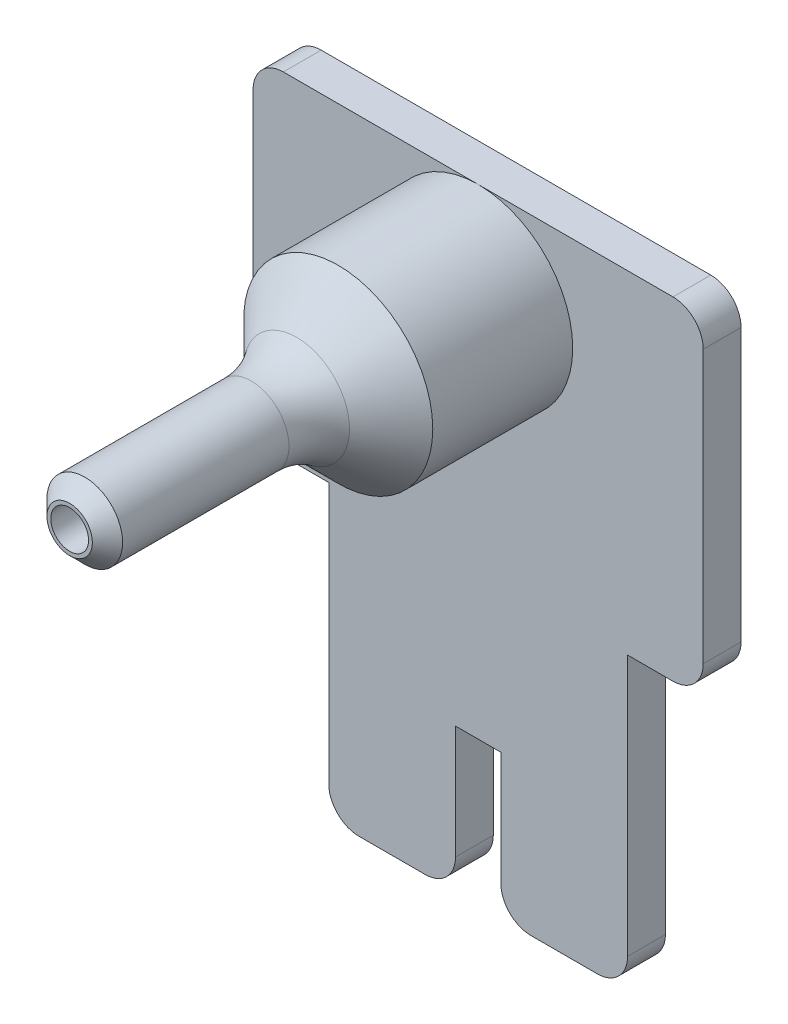
ISO-10303-21;
HEADER;
FILE_DESCRIPTION(('STEP AP214'),'2;1');
FILE_NAME('part.step','',(''),(''),'','','');
FILE_SCHEMA(('AUTOMOTIVE_DESIGN { 1 0 10303 214 1 1 1 1 }'));
ENDSEC;
DATA;
#1=APPLICATION_CONTEXT('core data for automotive mechanical design processes');
#2=APPLICATION_PROTOCOL_DEFINITION('international standard','automotive_design',2000,#1);
#3=PRODUCT_CONTEXT('',#1,'mechanical');
#4=PRODUCT('Part','Part','',(#3));
#5=PRODUCT_RELATED_PRODUCT_CATEGORY('part','',(#4));
#6=PRODUCT_DEFINITION_FORMATION('','',#4);
#7=PRODUCT_DEFINITION_CONTEXT('part definition',#1,'design');
#8=PRODUCT_DEFINITION('design','',#6,#7);
#9=PRODUCT_DEFINITION_SHAPE('','',#8);
#10=(LENGTH_UNIT() NAMED_UNIT(*) SI_UNIT(.MILLI.,.METRE.));
#11=(NAMED_UNIT(*) PLANE_ANGLE_UNIT() SI_UNIT($,.RADIAN.));
#12=(NAMED_UNIT(*) SI_UNIT($,.STERADIAN.) SOLID_ANGLE_UNIT());
#13=UNCERTAINTY_MEASURE_WITH_UNIT(LENGTH_MEASURE(1.E-05),#10,'distance_accuracy_value','');
#14=(GEOMETRIC_REPRESENTATION_CONTEXT(3) GLOBAL_UNCERTAINTY_ASSIGNED_CONTEXT((#13)) GLOBAL_UNIT_ASSIGNED_CONTEXT((#10,
#11,#12)) REPRESENTATION_CONTEXT('',''));
#15=CARTESIAN_POINT('',(0.,0.,0.));
#16=DIRECTION('',(0.,0.,1.));
#17=DIRECTION('',(1.,0.,0.));
#18=AXIS2_PLACEMENT_3D('',#15,#16,#17);
#19=CARTESIAN_POINT('',(0.,17.5,-17.6776695296637));
#20=DIRECTION('',(0.,0.,1.));
#21=DIRECTION('',(1.,0.,0.));
#22=AXIS2_PLACEMENT_3D('',#19,#20,#21);
#23=CYLINDRICAL_SURFACE('',#22,6.25);
#24=CARTESIAN_POINT('',(0.,17.5,11.75));
#25=DIRECTION('',(0.,0.,1.));
#26=DIRECTION('',(1.,0.,0.));
#27=AXIS2_PLACEMENT_3D('',#24,#25,#26);
#28=CIRCLE('',#27,6.25);
#29=CARTESIAN_POINT('',(6.25,17.5,11.75));
#30=VERTEX_POINT('',#29);
#31=EDGE_CURVE('E394',#30,#30,#28,.F.);
#32=ORIENTED_EDGE('',*,*,#31,.T.);
#33=EDGE_LOOP('',(#32));
#34=FACE_BOUND('',#33,.T.);
#35=CARTESIAN_POINT('',(0.,17.5,2.5));
#36=DIRECTION('',(0.,0.,-1.));
#37=DIRECTION('',(-1.,0.,0.));
#38=AXIS2_PLACEMENT_3D('',#35,#36,#37);
#39=CIRCLE('',#38,6.25);
#40=CARTESIAN_POINT('',(0.,23.75,2.5));
#41=VERTEX_POINT('',#40);
#42=EDGE_CURVE('E225',#41,#41,#39,.T.);
#43=ORIENTED_EDGE('',*,*,#42,.F.);
#44=EDGE_LOOP('',(#43));
#45=FACE_BOUND('',#44,.T.);
#46=ADVANCED_FACE('F76',(#34,#45),#23,.T.);
#47=CARTESIAN_POINT('',(0.,17.5,0.));
#48=DIRECTION('',(0.,0.,1.));
#49=DIRECTION('',(1.,0.,0.));
#50=AXIS2_PLACEMENT_3D('',#47,#48,#49);
#51=CYLINDRICAL_SURFACE('',#50,1.25);
#52=CARTESIAN_POINT('',(0.,17.5,29.5));
#53=DIRECTION('',(0.,0.,1.));
#54=DIRECTION('',(1.,0.,0.));
#55=AXIS2_PLACEMENT_3D('',#52,#53,#54);
#56=CIRCLE('',#55,1.25);
#57=CARTESIAN_POINT('',(1.25,17.5,29.5));
#58=VERTEX_POINT('',#57);
#59=EDGE_CURVE('E262',#58,#58,#56,.T.);
#60=ORIENTED_EDGE('',*,*,#59,.T.);
#61=EDGE_LOOP('',(#60));
#62=FACE_BOUND('',#61,.T.);
#63=CARTESIAN_POINT('',(0.,17.5,12.));
#64=DIRECTION('',(0.,0.,-1.));
#65=DIRECTION('',(-1.,0.,0.));
#66=AXIS2_PLACEMENT_3D('',#63,#64,#65);
#67=CIRCLE('',#66,1.25);
#68=CARTESIAN_POINT('',(-1.25,17.5,12.));
#69=VERTEX_POINT('',#68);
#70=EDGE_CURVE('E254',#69,#69,#67,.F.);
#71=ORIENTED_EDGE('',*,*,#70,.F.);
#72=EDGE_LOOP('',(#71));
#73=FACE_BOUND('',#72,.T.);
#74=ADVANCED_FACE('F418',(#62,#73),#51,.F.);
#75=CARTESIAN_POINT('',(-9.875,-17.5,2.5));
#76=DIRECTION('',(0.,1.,0.));
#77=DIRECTION('',(0.,0.,1.));
#78=AXIS2_PLACEMENT_3D('',#75,#76,#77);
#79=PLANE('',#78);
#80=DIRECTION('',(1.,0.,0.));
#81=VECTOR('',#80,1.);
#82=CARTESIAN_POINT('',(-9.875,-17.5,2.5));
#83=LINE('',#82,#81);
#84=CARTESIAN_POINT('',(3.49999999999999,-17.5,2.5));
#85=VERTEX_POINT('',#84);
#86=CARTESIAN_POINT('',(7.875,-17.5,2.5));
#87=VERTEX_POINT('',#86);
#88=EDGE_CURVE('E314',#85,#87,#83,.T.);
#89=ORIENTED_EDGE('',*,*,#88,.F.);
#90=DIRECTION('',(0.,0.,1.));
#91=VECTOR('',#90,1.);
#92=CARTESIAN_POINT('',(3.49999999999999,-17.5,2.5));
#93=LINE('',#92,#91);
#94=CARTESIAN_POINT('',(3.49999999999999,-17.5,0.));
#95=VERTEX_POINT('',#94);
#96=EDGE_CURVE('E375',#85,#95,#93,.F.);
#97=ORIENTED_EDGE('',*,*,#96,.T.);
#98=DIRECTION('',(1.,0.,0.));
#99=VECTOR('',#98,1.);
#100=CARTESIAN_POINT('',(-9.875,-17.5,0.));
#101=LINE('',#100,#99);
#102=CARTESIAN_POINT('',(7.875,-17.5,0.));
#103=VERTEX_POINT('',#102);
#104=EDGE_CURVE('E322',#95,#103,#101,.T.);
#105=ORIENTED_EDGE('',*,*,#104,.T.);
#106=DIRECTION('',(0.,0.,-1.));
#107=VECTOR('',#106,1.);
#108=CARTESIAN_POINT('',(7.875,-17.5,2.5));
#109=LINE('',#108,#107);
#110=EDGE_CURVE('E373',#103,#87,#109,.F.);
#111=ORIENTED_EDGE('',*,*,#110,.T.);
#112=EDGE_LOOP('',(#89,#97,#105,#111));
#113=FACE_BOUND('',#112,.T.);
#114=ADVANCED_FACE('F420',(#113),#79,.F.);
#115=CARTESIAN_POINT('',(9.875,-17.5,2.5));
#116=DIRECTION('',(-1.,0.,0.));
#117=DIRECTION('',(0.,0.,1.));
#118=AXIS2_PLACEMENT_3D('',#115,#116,#117);
#119=PLANE('',#118);
#120=DIRECTION('',(0.,1.,0.));
#121=VECTOR('',#120,1.);
#122=CARTESIAN_POINT('',(9.875,-17.5,2.5));
#123=LINE('',#122,#121);
#124=CARTESIAN_POINT('',(9.875,-15.5,2.5));
#125=VERTEX_POINT('',#124);
#126=CARTESIAN_POINT('',(9.875,1.74999999999999,2.5));
#127=VERTEX_POINT('',#126);
#128=EDGE_CURVE('E308',#125,#127,#123,.T.);
#129=ORIENTED_EDGE('',*,*,#128,.F.);
#130=DIRECTION('',(0.,0.,-1.));
#131=VECTOR('',#130,1.);
#132=CARTESIAN_POINT('',(9.875,-15.5,2.5));
#133=LINE('',#132,#131);
#134=CARTESIAN_POINT('',(9.875,-15.5,0.));
#135=VERTEX_POINT('',#134);
#136=EDGE_CURVE('E377',#125,#135,#133,.T.);
#137=ORIENTED_EDGE('',*,*,#136,.T.);
#138=DIRECTION('',(0.,1.,0.));
#139=VECTOR('',#138,1.);
#140=CARTESIAN_POINT('',(9.875,-17.5,0.));
#141=LINE('',#140,#139);
#142=CARTESIAN_POINT('',(9.875,1.74999999999999,0.));
#143=VERTEX_POINT('',#142);
#144=EDGE_CURVE('E305',#135,#143,#141,.T.);
#145=ORIENTED_EDGE('',*,*,#144,.T.);
#146=DIRECTION('',(0.,0.,1.));
#147=VECTOR('',#146,1.);
#148=CARTESIAN_POINT('',(9.875,1.74999999999999,2.5));
#149=LINE('',#148,#147);
#150=EDGE_CURVE('E283',#143,#127,#149,.T.);
#151=ORIENTED_EDGE('',*,*,#150,.T.);
#152=EDGE_LOOP('',(#129,#137,#145,#151));
#153=FACE_BOUND('',#152,.T.);
#154=ADVANCED_FACE('F427',(#153),#119,.F.);
#155=CARTESIAN_POINT('',(-9.875,-17.5,2.5));
#156=DIRECTION('',(1.,0.,0.));
#157=DIRECTION('',(0.,0.,-1.));
#158=AXIS2_PLACEMENT_3D('',#155,#156,#157);
#159=PLANE('',#158);
#160=DIRECTION('',(0.,-1.,0.));
#161=VECTOR('',#160,1.);
#162=CARTESIAN_POINT('',(-9.875,-17.5,0.));
#163=LINE('',#162,#161);
#164=CARTESIAN_POINT('',(-9.875,1.74999999999999,0.));
#165=VERTEX_POINT('',#164);
#166=CARTESIAN_POINT('',(-9.875,-15.5,0.));
#167=VERTEX_POINT('',#166);
#168=EDGE_CURVE('E319',#165,#167,#163,.T.);
#169=ORIENTED_EDGE('',*,*,#168,.T.);
#170=DIRECTION('',(0.,0.,-1.));
#171=VECTOR('',#170,1.);
#172=CARTESIAN_POINT('',(-9.875,-15.5,2.5));
#173=LINE('',#172,#171);
#174=CARTESIAN_POINT('',(-9.875,-15.5,2.5));
#175=VERTEX_POINT('',#174);
#176=EDGE_CURVE('E380',#167,#175,#173,.F.);
#177=ORIENTED_EDGE('',*,*,#176,.T.);
#178=DIRECTION('',(0.,-1.,0.));
#179=VECTOR('',#178,1.);
#180=CARTESIAN_POINT('',(-9.875,-17.5,2.5));
#181=LINE('',#180,#179);
#182=CARTESIAN_POINT('',(-9.875,1.74999999999999,2.5));
#183=VERTEX_POINT('',#182);
#184=EDGE_CURVE('E310',#183,#175,#181,.T.);
#185=ORIENTED_EDGE('',*,*,#184,.F.);
#186=DIRECTION('',(0.,0.,-1.));
#187=VECTOR('',#186,1.);
#188=CARTESIAN_POINT('',(-9.875,1.74999999999999,2.5));
#189=LINE('',#188,#187);
#190=EDGE_CURVE('E275',#183,#165,#189,.T.);
#191=ORIENTED_EDGE('',*,*,#190,.T.);
#192=EDGE_LOOP('',(#169,#177,#185,#191));
#193=FACE_BOUND('',#192,.T.);
#194=ADVANCED_FACE('F473',(#193),#159,.F.);
#195=CARTESIAN_POINT('',(-7.875,-17.5,0.));
#196=VERTEX_POINT('',#195);
#197=CARTESIAN_POINT('',(-3.5,-17.5,0.));
#198=VERTEX_POINT('',#197);
#199=EDGE_CURVE('E311',#196,#198,#101,.T.);
#200=ORIENTED_EDGE('',*,*,#199,.T.);
#201=DIRECTION('',(0.,0.,1.));
#202=VECTOR('',#201,1.);
#203=CARTESIAN_POINT('',(-3.5,-17.5,2.5));
#204=LINE('',#203,#202);
#205=CARTESIAN_POINT('',(-3.5,-17.5,2.5));
#206=VERTEX_POINT('',#205);
#207=EDGE_CURVE('E342',#198,#206,#204,.T.);
#208=ORIENTED_EDGE('',*,*,#207,.T.);
#209=CARTESIAN_POINT('',(-7.875,-17.5,2.5));
#210=VERTEX_POINT('',#209);
#211=EDGE_CURVE('E317',#210,#206,#83,.T.);
#212=ORIENTED_EDGE('',*,*,#211,.F.);
#213=DIRECTION('',(0.,0.,-1.));
#214=VECTOR('',#213,1.);
#215=CARTESIAN_POINT('',(-7.875,-17.5,2.5));
#216=LINE('',#215,#214);
#217=EDGE_CURVE('E339',#210,#196,#216,.T.);
#218=ORIENTED_EDGE('',*,*,#217,.T.);
#219=EDGE_LOOP('',(#200,#208,#212,#218));
#220=FACE_BOUND('',#219,.T.);
#221=ADVANCED_FACE('F430',(#220),#79,.F.);
#222=CARTESIAN_POINT('',(0.,0.,2.5));
#223=DIRECTION('',(0.,0.,-1.));
#224=DIRECTION('',(-1.,0.,0.));
#225=AXIS2_PLACEMENT_3D('',#222,#223,#224);
#226=PLANE('',#225);
#227=DIRECTION('',(1.,0.,0.));
#228=VECTOR('',#227,1.);
#229=CARTESIAN_POINT('',(0.,23.75,2.5));
#230=LINE('',#229,#228);
#231=CARTESIAN_POINT('',(12.875,23.75,2.5));
#232=VERTEX_POINT('',#231);
#233=EDGE_CURVE('E248',#41,#232,#230,.T.);
#234=ORIENTED_EDGE('',*,*,#233,.F.);
#235=ORIENTED_EDGE('',*,*,#42,.T.);
#236=DIRECTION('',(1.,0.,0.));
#237=VECTOR('',#236,1.);
#238=CARTESIAN_POINT('',(0.,23.75,2.5));
#239=LINE('',#238,#237);
#240=CARTESIAN_POINT('',(-12.875,23.75,2.5));
#241=VERTEX_POINT('',#240);
#242=EDGE_CURVE('E217',#241,#41,#239,.T.);
#243=ORIENTED_EDGE('',*,*,#242,.F.);
#244=CARTESIAN_POINT('',(-12.875,21.75,2.5));
#245=DIRECTION('',(0.,0.,-1.));
#246=DIRECTION('',(-1.,0.,0.));
#247=AXIS2_PLACEMENT_3D('',#244,#245,#246);
#248=CIRCLE('',#247,2.);
#249=CARTESIAN_POINT('',(-14.875,21.75,2.5));
#250=VERTEX_POINT('',#249);
#251=EDGE_CURVE('E222',#250,#241,#248,.T.);
#252=ORIENTED_EDGE('',*,*,#251,.F.);
#253=DIRECTION('',(0.,-1.,0.));
#254=VECTOR('',#253,1.);
#255=CARTESIAN_POINT('',(-14.875,17.5,2.5));
#256=LINE('',#255,#254);
#257=CARTESIAN_POINT('',(-14.875,3.74999999999999,2.5));
#258=VERTEX_POINT('',#257);
#259=EDGE_CURVE('E266',#250,#258,#256,.T.);
#260=ORIENTED_EDGE('',*,*,#259,.T.);
#261=CARTESIAN_POINT('',(-12.875,3.74999999999999,2.5));
#262=DIRECTION('',(0.,0.,-1.));
#263=DIRECTION('',(-1.,0.,0.));
#264=AXIS2_PLACEMENT_3D('',#261,#262,#263);
#265=CIRCLE('',#264,2.);
#266=CARTESIAN_POINT('',(-12.875,1.74999999999999,2.5));
#267=VERTEX_POINT('',#266);
#268=EDGE_CURVE('E347',#258,#267,#265,.F.);
#269=ORIENTED_EDGE('',*,*,#268,.T.);
#270=DIRECTION('',(1.,0.,0.));
#271=VECTOR('',#270,1.);
#272=CARTESIAN_POINT('',(-14.875,1.74999999999999,2.5));
#273=LINE('',#272,#271);
#274=EDGE_CURVE('E278',#267,#183,#273,.T.);
#275=ORIENTED_EDGE('',*,*,#274,.T.);
#276=ORIENTED_EDGE('',*,*,#184,.T.);
#277=CARTESIAN_POINT('',(-7.875,-15.5,2.5));
#278=DIRECTION('',(0.,0.,-1.));
#279=DIRECTION('',(-1.,0.,0.));
#280=AXIS2_PLACEMENT_3D('',#277,#278,#279);
#281=CIRCLE('',#280,2.);
#282=EDGE_CURVE('E349',#175,#210,#281,.F.);
#283=ORIENTED_EDGE('',*,*,#282,.T.);
#284=ORIENTED_EDGE('',*,*,#211,.T.);
#285=CARTESIAN_POINT('',(-3.5,-15.5,2.5));
#286=DIRECTION('',(0.,0.,-1.));
#287=DIRECTION('',(-1.,0.,0.));
#288=AXIS2_PLACEMENT_3D('',#285,#286,#287);
#289=CIRCLE('',#288,2.);
#290=CARTESIAN_POINT('',(-1.5,-15.5,2.5));
#291=VERTEX_POINT('',#290);
#292=EDGE_CURVE('E355',#206,#291,#289,.F.);
#293=ORIENTED_EDGE('',*,*,#292,.T.);
#294=DIRECTION('',(0.,-1.,0.));
#295=VECTOR('',#294,1.);
#296=CARTESIAN_POINT('',(-1.49999999999999,-17.5,2.5));
#297=LINE('',#296,#295);
#298=CARTESIAN_POINT('',(-1.50000000000001,-8.00000000000001,2.5));
#299=VERTEX_POINT('',#298);
#300=EDGE_CURVE('E290',#299,#291,#297,.T.);
#301=ORIENTED_EDGE('',*,*,#300,.F.);
#302=DIRECTION('',(-1.,0.,0.));
#303=VECTOR('',#302,1.);
#304=CARTESIAN_POINT('',(1.49999999999999,-8.00000000000001,2.5));
#305=LINE('',#304,#303);
#306=CARTESIAN_POINT('',(1.49999999999999,-8.00000000000001,2.5));
#307=VERTEX_POINT('',#306);
#308=EDGE_CURVE('E298',#307,#299,#305,.T.);
#309=ORIENTED_EDGE('',*,*,#308,.F.);
#310=DIRECTION('',(0.,1.,0.));
#311=VECTOR('',#310,1.);
#312=CARTESIAN_POINT('',(1.49999999999999,-17.5,2.5));
#313=LINE('',#312,#311);
#314=CARTESIAN_POINT('',(1.49999999999999,-15.5,2.5));
#315=VERTEX_POINT('',#314);
#316=EDGE_CURVE('E286',#315,#307,#313,.T.);
#317=ORIENTED_EDGE('',*,*,#316,.F.);
#318=CARTESIAN_POINT('',(3.49999999999999,-15.5,2.5));
#319=DIRECTION('',(0.,0.,-1.));
#320=DIRECTION('',(-1.,0.,0.));
#321=AXIS2_PLACEMENT_3D('',#318,#319,#320);
#322=CIRCLE('',#321,2.);
#323=EDGE_CURVE('E353',#315,#85,#322,.F.);
#324=ORIENTED_EDGE('',*,*,#323,.T.);
#325=ORIENTED_EDGE('',*,*,#88,.T.);
#326=CARTESIAN_POINT('',(7.875,-15.5,2.5));
#327=DIRECTION('',(0.,0.,-1.));
#328=DIRECTION('',(-1.,0.,0.));
#329=AXIS2_PLACEMENT_3D('',#326,#327,#328);
#330=CIRCLE('',#329,2.);
#331=EDGE_CURVE('E351',#87,#125,#330,.F.);
#332=ORIENTED_EDGE('',*,*,#331,.T.);
#333=ORIENTED_EDGE('',*,*,#128,.T.);
#334=CARTESIAN_POINT('',(12.875,1.74999999999999,2.5));
#335=VERTEX_POINT('',#334);
#336=EDGE_CURVE('E277',#127,#335,#273,.T.);
#337=ORIENTED_EDGE('',*,*,#336,.T.);
#338=CARTESIAN_POINT('',(12.875,3.74999999999999,2.5));
#339=DIRECTION('',(0.,0.,-1.));
#340=DIRECTION('',(-1.,0.,0.));
#341=AXIS2_PLACEMENT_3D('',#338,#339,#340);
#342=CIRCLE('',#341,2.);
#343=CARTESIAN_POINT('',(14.875,3.74999999999999,2.5));
#344=VERTEX_POINT('',#343);
#345=EDGE_CURVE('E345',#335,#344,#342,.F.);
#346=ORIENTED_EDGE('',*,*,#345,.T.);
#347=DIRECTION('',(0.,1.,0.));
#348=VECTOR('',#347,1.);
#349=CARTESIAN_POINT('',(14.875,17.5,2.5));
#350=LINE('',#349,#348);
#351=CARTESIAN_POINT('',(14.875,21.75,2.5));
#352=VERTEX_POINT('',#351);
#353=EDGE_CURVE('E270',#344,#352,#350,.T.);
#354=ORIENTED_EDGE('',*,*,#353,.T.);
#355=CARTESIAN_POINT('',(12.875,21.75,2.5));
#356=DIRECTION('',(0.,0.,-1.));
#357=DIRECTION('',(-1.,0.,0.));
#358=AXIS2_PLACEMENT_3D('',#355,#356,#357);
#359=CIRCLE('',#358,2.);
#360=EDGE_CURVE('E250',#232,#352,#359,.T.);
#361=ORIENTED_EDGE('',*,*,#360,.F.);
#362=EDGE_LOOP('',(#234,#235,#243,#252,#260,#269,#275,#276,#283,#284,#293,#301,#309,#317,#324,
#325,#332,#333,#337,#346,#354,#361));
#363=FACE_BOUND('',#362,.T.);
#364=ADVANCED_FACE('F220',(#363),#226,.F.);
#365=CARTESIAN_POINT('',(0.,0.,0.));
#366=DIRECTION('',(0.,0.,-1.));
#367=DIRECTION('',(-1.,0.,0.));
#368=AXIS2_PLACEMENT_3D('',#365,#366,#367);
#369=PLANE('',#368);
#370=CARTESIAN_POINT('',(-12.875,21.75,0.));
#371=DIRECTION('',(0.,0.,-1.));
#372=DIRECTION('',(-1.,0.,0.));
#373=AXIS2_PLACEMENT_3D('',#370,#371,#372);
#374=CIRCLE('',#373,2.);
#375=CARTESIAN_POINT('',(-12.875,23.75,0.));
#376=VERTEX_POINT('',#375);
#377=CARTESIAN_POINT('',(-14.875,21.75,0.));
#378=VERTEX_POINT('',#377);
#379=EDGE_CURVE('E242',#376,#378,#374,.F.);
#380=ORIENTED_EDGE('',*,*,#379,.F.);
#381=DIRECTION('',(-1.,0.,0.));
#382=VECTOR('',#381,1.);
#383=CARTESIAN_POINT('',(0.,23.75,0.));
#384=LINE('',#383,#382);
#385=CARTESIAN_POINT('',(12.875,23.75,0.));
#386=VERTEX_POINT('',#385);
#387=EDGE_CURVE('E241',#386,#376,#384,.T.);
#388=ORIENTED_EDGE('',*,*,#387,.F.);
#389=CARTESIAN_POINT('',(12.875,21.75,0.));
#390=DIRECTION('',(0.,0.,-1.));
#391=DIRECTION('',(-1.,0.,0.));
#392=AXIS2_PLACEMENT_3D('',#389,#390,#391);
#393=CIRCLE('',#392,2.);
#394=CARTESIAN_POINT('',(14.875,21.75,0.));
#395=VERTEX_POINT('',#394);
#396=EDGE_CURVE('E244',#395,#386,#393,.F.);
#397=ORIENTED_EDGE('',*,*,#396,.F.);
#398=DIRECTION('',(0.,1.,0.));
#399=VECTOR('',#398,1.);
#400=CARTESIAN_POINT('',(14.875,17.5,0.));
#401=LINE('',#400,#399);
#402=CARTESIAN_POINT('',(14.875,3.74999999999999,0.));
#403=VERTEX_POINT('',#402);
#404=EDGE_CURVE('E273',#403,#395,#401,.T.);
#405=ORIENTED_EDGE('',*,*,#404,.F.);
#406=CARTESIAN_POINT('',(12.875,3.74999999999999,0.));
#407=DIRECTION('',(0.,0.,-1.));
#408=DIRECTION('',(-1.,0.,0.));
#409=AXIS2_PLACEMENT_3D('',#406,#407,#408);
#410=CIRCLE('',#409,2.);
#411=CARTESIAN_POINT('',(12.875,1.74999999999999,0.));
#412=VERTEX_POINT('',#411);
#413=EDGE_CURVE('E359',#403,#412,#410,.T.);
#414=ORIENTED_EDGE('',*,*,#413,.T.);
#415=DIRECTION('',(1.,0.,0.));
#416=VECTOR('',#415,1.);
#417=CARTESIAN_POINT('',(-14.875,1.74999999999999,0.));
#418=LINE('',#417,#416);
#419=EDGE_CURVE('E269',#143,#412,#418,.T.);
#420=ORIENTED_EDGE('',*,*,#419,.F.);
#421=ORIENTED_EDGE('',*,*,#144,.F.);
#422=CARTESIAN_POINT('',(7.875,-15.5,0.));
#423=DIRECTION('',(0.,0.,-1.));
#424=DIRECTION('',(-1.,0.,0.));
#425=AXIS2_PLACEMENT_3D('',#422,#423,#424);
#426=CIRCLE('',#425,2.);
#427=EDGE_CURVE('E364',#135,#103,#426,.T.);
#428=ORIENTED_EDGE('',*,*,#427,.T.);
#429=ORIENTED_EDGE('',*,*,#104,.F.);
#430=CARTESIAN_POINT('',(3.49999999999999,-15.5,0.));
#431=DIRECTION('',(0.,0.,-1.));
#432=DIRECTION('',(-1.,0.,0.));
#433=AXIS2_PLACEMENT_3D('',#430,#431,#432);
#434=CIRCLE('',#433,2.);
#435=CARTESIAN_POINT('',(1.49999999999999,-15.5,0.));
#436=VERTEX_POINT('',#435);
#437=EDGE_CURVE('E366',#95,#436,#434,.T.);
#438=ORIENTED_EDGE('',*,*,#437,.T.);
#439=DIRECTION('',(0.,1.,0.));
#440=VECTOR('',#439,1.);
#441=CARTESIAN_POINT('',(1.49999999999999,-17.5,0.));
#442=LINE('',#441,#440);
#443=CARTESIAN_POINT('',(1.49999999999999,-8.00000000000001,0.));
#444=VERTEX_POINT('',#443);
#445=EDGE_CURVE('E287',#436,#444,#442,.T.);
#446=ORIENTED_EDGE('',*,*,#445,.T.);
#447=DIRECTION('',(-1.,0.,0.));
#448=VECTOR('',#447,1.);
#449=CARTESIAN_POINT('',(1.49999999999999,-8.00000000000001,0.));
#450=LINE('',#449,#448);
#451=CARTESIAN_POINT('',(-1.50000000000001,-8.00000000000001,0.));
#452=VERTEX_POINT('',#451);
#453=EDGE_CURVE('E289',#444,#452,#450,.T.);
#454=ORIENTED_EDGE('',*,*,#453,.T.);
#455=DIRECTION('',(0.,-1.,0.));
#456=VECTOR('',#455,1.);
#457=CARTESIAN_POINT('',(-1.49999999999999,-17.5,0.));
#458=LINE('',#457,#456);
#459=CARTESIAN_POINT('',(-1.5,-15.5,0.));
#460=VERTEX_POINT('',#459);
#461=EDGE_CURVE('E293',#452,#460,#458,.T.);
#462=ORIENTED_EDGE('',*,*,#461,.T.);
#463=CARTESIAN_POINT('',(-3.5,-15.5,0.));
#464=DIRECTION('',(0.,0.,-1.));
#465=DIRECTION('',(-1.,0.,0.));
#466=AXIS2_PLACEMENT_3D('',#463,#464,#465);
#467=CIRCLE('',#466,2.);
#468=EDGE_CURVE('E368',#460,#198,#467,.T.);
#469=ORIENTED_EDGE('',*,*,#468,.T.);
#470=ORIENTED_EDGE('',*,*,#199,.F.);
#471=CARTESIAN_POINT('',(-7.875,-15.5,0.));
#472=DIRECTION('',(0.,0.,-1.));
#473=DIRECTION('',(-1.,0.,0.));
#474=AXIS2_PLACEMENT_3D('',#471,#472,#473);
#475=CIRCLE('',#474,2.);
#476=EDGE_CURVE('E362',#196,#167,#475,.T.);
#477=ORIENTED_EDGE('',*,*,#476,.T.);
#478=ORIENTED_EDGE('',*,*,#168,.F.);
#479=CARTESIAN_POINT('',(-12.875,1.74999999999999,0.));
#480=VERTEX_POINT('',#479);
#481=EDGE_CURVE('E271',#480,#165,#418,.T.);
#482=ORIENTED_EDGE('',*,*,#481,.F.);
#483=CARTESIAN_POINT('',(-12.875,3.74999999999999,0.));
#484=DIRECTION('',(0.,0.,-1.));
#485=DIRECTION('',(-1.,0.,0.));
#486=AXIS2_PLACEMENT_3D('',#483,#484,#485);
#487=CIRCLE('',#486,2.);
#488=CARTESIAN_POINT('',(-14.875,3.74999999999999,0.));
#489=VERTEX_POINT('',#488);
#490=EDGE_CURVE('E91',#480,#489,#487,.T.);
#491=ORIENTED_EDGE('',*,*,#490,.T.);
#492=DIRECTION('',(0.,-1.,0.));
#493=VECTOR('',#492,1.);
#494=CARTESIAN_POINT('',(-14.875,17.5,0.));
#495=LINE('',#494,#493);
#496=EDGE_CURVE('E267',#378,#489,#495,.T.);
#497=ORIENTED_EDGE('',*,*,#496,.F.);
#498=EDGE_LOOP('',(#380,#388,#397,#405,#414,#420,#421,#428,#429,#438,#446,#454,#462,#469,#470,
#477,#478,#482,#491,#497));
#499=FACE_BOUND('',#498,.T.);
#500=CARTESIAN_POINT('',(0.,17.5,0.));
#501=DIRECTION('',(0.,0.,-1.));
#502=DIRECTION('',(-1.,0.,0.));
#503=AXIS2_PLACEMENT_3D('',#500,#501,#502);
#504=CIRCLE('',#503,5.12500000000001);
#505=CARTESIAN_POINT('',(-5.12500000000001,17.5,0.));
#506=VERTEX_POINT('',#505);
#507=EDGE_CURVE('E330',#506,#506,#504,.F.);
#508=ORIENTED_EDGE('',*,*,#507,.T.);
#509=EDGE_LOOP('',(#508));
#510=FACE_BOUND('',#509,.T.);
#511=ADVANCED_FACE('F466',(#499,#510),#369,.T.);
#512=CARTESIAN_POINT('',(1.49999999999999,-17.5,0.));
#513=DIRECTION('',(1.,0.,0.));
#514=DIRECTION('',(0.,0.,-1.));
#515=AXIS2_PLACEMENT_3D('',#512,#513,#514);
#516=PLANE('',#515);
#517=ORIENTED_EDGE('',*,*,#445,.F.);
#518=DIRECTION('',(0.,0.,1.));
#519=VECTOR('',#518,1.);
#520=CARTESIAN_POINT('',(1.49999999999999,-15.5,0.));
#521=LINE('',#520,#519);
#522=EDGE_CURVE('E370',#436,#315,#521,.T.);
#523=ORIENTED_EDGE('',*,*,#522,.T.);
#524=ORIENTED_EDGE('',*,*,#316,.T.);
#525=DIRECTION('',(0.,0.,1.));
#526=VECTOR('',#525,1.);
#527=CARTESIAN_POINT('',(1.49999999999999,-8.00000000000001,0.));
#528=LINE('',#527,#526);
#529=EDGE_CURVE('E296',#444,#307,#528,.T.);
#530=ORIENTED_EDGE('',*,*,#529,.F.);
#531=EDGE_LOOP('',(#517,#523,#524,#530));
#532=FACE_BOUND('',#531,.T.);
#533=ADVANCED_FACE('F459',(#532),#516,.F.);
#534=CARTESIAN_POINT('',(-1.49999999999999,-17.5,0.));
#535=DIRECTION('',(-1.,0.,0.));
#536=DIRECTION('',(0.,-1.,0.));
#537=AXIS2_PLACEMENT_3D('',#534,#535,#536);
#538=PLANE('',#537);
#539=ORIENTED_EDGE('',*,*,#300,.T.);
#540=DIRECTION('',(0.,0.,1.));
#541=VECTOR('',#540,1.);
#542=CARTESIAN_POINT('',(-1.5,-15.5,0.));
#543=LINE('',#542,#541);
#544=EDGE_CURVE('E357',#291,#460,#543,.F.);
#545=ORIENTED_EDGE('',*,*,#544,.T.);
#546=ORIENTED_EDGE('',*,*,#461,.F.);
#547=DIRECTION('',(0.,0.,1.));
#548=VECTOR('',#547,1.);
#549=CARTESIAN_POINT('',(-1.50000000000001,-8.00000000000001,0.));
#550=LINE('',#549,#548);
#551=EDGE_CURVE('E303',#452,#299,#550,.T.);
#552=ORIENTED_EDGE('',*,*,#551,.T.);
#553=EDGE_LOOP('',(#539,#545,#546,#552));
#554=FACE_BOUND('',#553,.T.);
#555=ADVANCED_FACE('F456',(#554),#538,.F.);
#556=CARTESIAN_POINT('',(1.49999999999999,-8.00000000000001,0.));
#557=DIRECTION('',(0.,1.,0.));
#558=DIRECTION('',(0.,0.,1.));
#559=AXIS2_PLACEMENT_3D('',#556,#557,#558);
#560=PLANE('',#559);
#561=ORIENTED_EDGE('',*,*,#308,.T.);
#562=ORIENTED_EDGE('',*,*,#551,.F.);
#563=ORIENTED_EDGE('',*,*,#453,.F.);
#564=ORIENTED_EDGE('',*,*,#529,.T.);
#565=EDGE_LOOP('',(#561,#562,#563,#564));
#566=FACE_BOUND('',#565,.T.);
#567=ADVANCED_FACE('F454',(#566),#560,.F.);
#568=CARTESIAN_POINT('',(-14.875,17.5,0.));
#569=DIRECTION('',(-1.,0.,0.));
#570=DIRECTION('',(0.,-1.,0.));
#571=AXIS2_PLACEMENT_3D('',#568,#569,#570);
#572=PLANE('',#571);
#573=ORIENTED_EDGE('',*,*,#496,.T.);
#574=DIRECTION('',(0.,0.,1.));
#575=VECTOR('',#574,1.);
#576=CARTESIAN_POINT('',(-14.875,3.74999999999999,0.));
#577=LINE('',#576,#575);
#578=EDGE_CURVE('E382',#489,#258,#577,.T.);
#579=ORIENTED_EDGE('',*,*,#578,.T.);
#580=ORIENTED_EDGE('',*,*,#259,.F.);
#581=DIRECTION('',(0.,0.,-1.));
#582=VECTOR('',#581,1.);
#583=CARTESIAN_POINT('',(-14.875,21.75,19.5096479975336));
#584=LINE('',#583,#582);
#585=EDGE_CURVE('E229',#250,#378,#584,.T.);
#586=ORIENTED_EDGE('',*,*,#585,.T.);
#587=EDGE_LOOP('',(#573,#579,#580,#586));
#588=FACE_BOUND('',#587,.T.);
#589=ADVANCED_FACE('F451',(#588),#572,.T.);
#590=CARTESIAN_POINT('',(-14.875,1.74999999999999,0.));
#591=DIRECTION('',(0.,-1.,0.));
#592=DIRECTION('',(0.,0.,-1.));
#593=AXIS2_PLACEMENT_3D('',#590,#591,#592);
#594=PLANE('',#593);
#595=ORIENTED_EDGE('',*,*,#274,.F.);
#596=DIRECTION('',(0.,0.,1.));
#597=VECTOR('',#596,1.);
#598=CARTESIAN_POINT('',(-12.875,1.74999999999999,0.));
#599=LINE('',#598,#597);
#600=EDGE_CURVE('E99',#267,#480,#599,.F.);
#601=ORIENTED_EDGE('',*,*,#600,.T.);
#602=ORIENTED_EDGE('',*,*,#481,.T.);
#603=ORIENTED_EDGE('',*,*,#190,.F.);
#604=EDGE_LOOP('',(#595,#601,#602,#603));
#605=FACE_BOUND('',#604,.T.);
#606=ADVANCED_FACE('F449',(#605),#594,.T.);
#607=ORIENTED_EDGE('',*,*,#419,.T.);
#608=DIRECTION('',(0.,0.,1.));
#609=VECTOR('',#608,1.);
#610=CARTESIAN_POINT('',(12.875,1.74999999999999,0.));
#611=LINE('',#610,#609);
#612=EDGE_CURVE('E386',#412,#335,#611,.T.);
#613=ORIENTED_EDGE('',*,*,#612,.T.);
#614=ORIENTED_EDGE('',*,*,#336,.F.);
#615=ORIENTED_EDGE('',*,*,#150,.F.);
#616=EDGE_LOOP('',(#607,#613,#614,#615));
#617=FACE_BOUND('',#616,.T.);
#618=ADVANCED_FACE('F445',(#617),#594,.T.);
#619=CARTESIAN_POINT('',(14.875,17.5,0.));
#620=DIRECTION('',(1.,0.,0.));
#621=DIRECTION('',(0.,1.,0.));
#622=AXIS2_PLACEMENT_3D('',#619,#620,#621);
#623=PLANE('',#622);
#624=ORIENTED_EDGE('',*,*,#353,.F.);
#625=DIRECTION('',(0.,0.,1.));
#626=VECTOR('',#625,1.);
#627=CARTESIAN_POINT('',(14.875,3.74999999999999,0.));
#628=LINE('',#627,#626);
#629=EDGE_CURVE('E389',#344,#403,#628,.F.);
#630=ORIENTED_EDGE('',*,*,#629,.T.);
#631=ORIENTED_EDGE('',*,*,#404,.T.);
#632=DIRECTION('',(0.,0.,-1.));
#633=VECTOR('',#632,1.);
#634=CARTESIAN_POINT('',(14.875,21.75,19.5096479975336));
#635=LINE('',#634,#633);
#636=EDGE_CURVE('E258',#352,#395,#635,.T.);
#637=ORIENTED_EDGE('',*,*,#636,.F.);
#638=EDGE_LOOP('',(#624,#630,#631,#637));
#639=FACE_BOUND('',#638,.T.);
#640=ADVANCED_FACE('F440',(#639),#623,.T.);
#641=CARTESIAN_POINT('',(0.,17.5,29.5));
#642=DIRECTION('',(0.,0.,-1.));
#643=DIRECTION('',(-1.,0.,0.));
#644=AXIS2_PLACEMENT_3D('',#641,#642,#643);
#645=CYLINDRICAL_SURFACE('',#644,2.5);
#646=CARTESIAN_POINT('',(0.,17.5,17.5));
#647=DIRECTION('',(0.,0.,-1.));
#648=DIRECTION('',(-1.,0.,0.));
#649=AXIS2_PLACEMENT_3D('',#646,#647,#648);
#650=CIRCLE('',#649,2.5);
#651=CARTESIAN_POINT('',(-2.5,17.5,17.5));
#652=VERTEX_POINT('',#651);
#653=EDGE_CURVE('E12',#652,#652,#650,.F.);
#654=ORIENTED_EDGE('',*,*,#653,.T.);
#655=EDGE_LOOP('',(#654));
#656=FACE_BOUND('',#655,.T.);
#657=CARTESIAN_POINT('',(0.,17.5,28.5));
#658=DIRECTION('',(0.,0.,1.));
#659=DIRECTION('',(1.,0.,0.));
#660=AXIS2_PLACEMENT_3D('',#657,#658,#659);
#661=CIRCLE('',#660,2.5);
#662=CARTESIAN_POINT('',(2.5,17.5,28.5));
#663=VERTEX_POINT('',#662);
#664=EDGE_CURVE('E336',#663,#663,#661,.F.);
#665=ORIENTED_EDGE('',*,*,#664,.T.);
#666=EDGE_LOOP('',(#665));
#667=FACE_BOUND('',#666,.T.);
#668=ADVANCED_FACE('F437',(#656,#667),#645,.T.);
#669=CARTESIAN_POINT('',(0.,17.5,29.5));
#670=DIRECTION('',(0.,0.,1.));
#671=DIRECTION('',(1.,0.,0.));
#672=AXIS2_PLACEMENT_3D('',#669,#670,#671);
#673=PLANE('',#672);
#674=CARTESIAN_POINT('',(0.,17.5,29.5));
#675=DIRECTION('',(0.,0.,1.));
#676=DIRECTION('',(1.,0.,0.));
#677=AXIS2_PLACEMENT_3D('',#674,#675,#676);
#678=CIRCLE('',#677,1.5);
#679=CARTESIAN_POINT('',(1.5,17.5,29.5));
#680=VERTEX_POINT('',#679);
#681=EDGE_CURVE('E333',#680,#680,#678,.T.);
#682=ORIENTED_EDGE('',*,*,#681,.T.);
#683=EDGE_LOOP('',(#682));
#684=FACE_BOUND('',#683,.T.);
#685=ORIENTED_EDGE('',*,*,#59,.F.);
#686=EDGE_LOOP('',(#685));
#687=FACE_BOUND('',#686,.T.);
#688=ADVANCED_FACE('F414',(#684,#687),#673,.T.);
#689=CARTESIAN_POINT('',(0.,17.5,12.));
#690=DIRECTION('',(0.,0.,-1.));
#691=DIRECTION('',(-1.,0.,0.));
#692=AXIS2_PLACEMENT_3D('',#689,#690,#691);
#693=PLANE('',#692);
#694=CARTESIAN_POINT('',(0.,17.5,12.));
#695=DIRECTION('',(0.,0.,-1.));
#696=DIRECTION('',(-1.,0.,0.));
#697=AXIS2_PLACEMENT_3D('',#694,#695,#696);
#698=CIRCLE('',#697,1.37499999999999);
#699=CARTESIAN_POINT('',(-1.37499999999999,17.5,12.));
#700=VERTEX_POINT('',#699);
#701=EDGE_CURVE('E397',#700,#700,#698,.T.);
#702=ORIENTED_EDGE('',*,*,#701,.T.);
#703=EDGE_LOOP('',(#702));
#704=FACE_BOUND('',#703,.T.);
#705=ORIENTED_EDGE('',*,*,#70,.T.);
#706=EDGE_LOOP('',(#705));
#707=FACE_BOUND('',#706,.T.);
#708=ADVANCED_FACE('F411',(#704,#707),#693,.T.);
#709=CARTESIAN_POINT('',(0.,17.5,12.));
#710=DIRECTION('',(0.,0.,-1.));
#711=DIRECTION('',(-1.,0.,0.));
#712=AXIS2_PLACEMENT_3D('',#709,#710,#711);
#713=CYLINDRICAL_SURFACE('',#712,4.125);
#714=CARTESIAN_POINT('',(0.,17.5,9.25000000000002));
#715=DIRECTION('',(0.,0.,-1.));
#716=DIRECTION('',(-1.,0.,0.));
#717=AXIS2_PLACEMENT_3D('',#714,#715,#716);
#718=CIRCLE('',#717,4.125);
#719=CARTESIAN_POINT('',(-4.125,17.5,9.25000000000002));
#720=VERTEX_POINT('',#719);
#721=EDGE_CURVE('E84',#720,#720,#718,.F.);
#722=ORIENTED_EDGE('',*,*,#721,.T.);
#723=EDGE_LOOP('',(#722));
#724=FACE_BOUND('',#723,.T.);
#725=CARTESIAN_POINT('',(0.,17.5,1.));
#726=DIRECTION('',(0.,0.,-1.));
#727=DIRECTION('',(-1.,0.,0.));
#728=AXIS2_PLACEMENT_3D('',#725,#726,#727);
#729=CIRCLE('',#728,4.125);
#730=CARTESIAN_POINT('',(-4.125,17.5,1.));
#731=VERTEX_POINT('',#730);
#732=EDGE_CURVE('E327',#731,#731,#729,.T.);
#733=ORIENTED_EDGE('',*,*,#732,.T.);
#734=EDGE_LOOP('',(#733));
#735=FACE_BOUND('',#734,.T.);
#736=ADVANCED_FACE('F402',(#724,#735),#713,.F.);
#737=CARTESIAN_POINT('',(0.,17.5,1.));
#738=DIRECTION('',(0.,0.,-1.));
#739=DIRECTION('',(-1.,0.,0.));
#740=AXIS2_PLACEMENT_3D('',#737,#738,#739);
#741=CONICAL_SURFACE('',#740,4.125,0.785398163397452);
#742=ORIENTED_EDGE('',*,*,#507,.F.);
#743=EDGE_LOOP('',(#742));
#744=FACE_BOUND('',#743,.T.);
#745=ORIENTED_EDGE('',*,*,#732,.F.);
#746=EDGE_LOOP('',(#745));
#747=FACE_BOUND('',#746,.T.);
#748=ADVANCED_FACE('F481',(#744,#747),#741,.F.);
#749=CARTESIAN_POINT('',(0.,17.5,29.5));
#750=DIRECTION('',(0.,0.,-1.));
#751=DIRECTION('',(-1.,0.,0.));
#752=AXIS2_PLACEMENT_3D('',#749,#750,#751);
#753=CONICAL_SURFACE('',#752,1.5,0.785398163397448);
#754=ORIENTED_EDGE('',*,*,#664,.F.);
#755=EDGE_LOOP('',(#754));
#756=FACE_BOUND('',#755,.T.);
#757=ORIENTED_EDGE('',*,*,#681,.F.);
#758=EDGE_LOOP('',(#757));
#759=FACE_BOUND('',#758,.T.);
#760=ADVANCED_FACE('F484',(#756,#759),#753,.T.);
#761=CARTESIAN_POINT('',(-3.5,-15.5,2.5));
#762=DIRECTION('',(0.,0.,1.));
#763=DIRECTION('',(1.,0.,0.));
#764=AXIS2_PLACEMENT_3D('',#761,#762,#763);
#765=CYLINDRICAL_SURFACE('',#764,2.);
#766=ORIENTED_EDGE('',*,*,#468,.F.);
#767=ORIENTED_EDGE('',*,*,#544,.F.);
#768=ORIENTED_EDGE('',*,*,#292,.F.);
#769=ORIENTED_EDGE('',*,*,#207,.F.);
#770=EDGE_LOOP('',(#766,#767,#768,#769));
#771=FACE_BOUND('',#770,.T.);
#772=ADVANCED_FACE('F488',(#771),#765,.T.);
#773=CARTESIAN_POINT('',(3.49999999999999,-15.5,0.));
#774=DIRECTION('',(0.,0.,1.));
#775=DIRECTION('',(1.,0.,0.));
#776=AXIS2_PLACEMENT_3D('',#773,#774,#775);
#777=CYLINDRICAL_SURFACE('',#776,2.);
#778=ORIENTED_EDGE('',*,*,#437,.F.);
#779=ORIENTED_EDGE('',*,*,#96,.F.);
#780=ORIENTED_EDGE('',*,*,#323,.F.);
#781=ORIENTED_EDGE('',*,*,#522,.F.);
#782=EDGE_LOOP('',(#778,#779,#780,#781));
#783=FACE_BOUND('',#782,.T.);
#784=ADVANCED_FACE('F492',(#783),#777,.T.);
#785=CARTESIAN_POINT('',(7.875,-15.5,2.5));
#786=DIRECTION('',(0.,0.,-1.));
#787=DIRECTION('',(-1.,0.,0.));
#788=AXIS2_PLACEMENT_3D('',#785,#786,#787);
#789=CYLINDRICAL_SURFACE('',#788,2.);
#790=ORIENTED_EDGE('',*,*,#331,.F.);
#791=ORIENTED_EDGE('',*,*,#110,.F.);
#792=ORIENTED_EDGE('',*,*,#427,.F.);
#793=ORIENTED_EDGE('',*,*,#136,.F.);
#794=EDGE_LOOP('',(#790,#791,#792,#793));
#795=FACE_BOUND('',#794,.T.);
#796=ADVANCED_FACE('F496',(#795),#789,.T.);
#797=CARTESIAN_POINT('',(-7.875,-15.5,2.5));
#798=DIRECTION('',(0.,0.,-1.));
#799=DIRECTION('',(-1.,0.,0.));
#800=AXIS2_PLACEMENT_3D('',#797,#798,#799);
#801=CYLINDRICAL_SURFACE('',#800,2.);
#802=ORIENTED_EDGE('',*,*,#282,.F.);
#803=ORIENTED_EDGE('',*,*,#176,.F.);
#804=ORIENTED_EDGE('',*,*,#476,.F.);
#805=ORIENTED_EDGE('',*,*,#217,.F.);
#806=EDGE_LOOP('',(#802,#803,#804,#805));
#807=FACE_BOUND('',#806,.T.);
#808=ADVANCED_FACE('F500',(#807),#801,.T.);
#809=CARTESIAN_POINT('',(-12.875,3.74999999999999,0.));
#810=DIRECTION('',(0.,0.,1.));
#811=DIRECTION('',(1.,0.,0.));
#812=AXIS2_PLACEMENT_3D('',#809,#810,#811);
#813=CYLINDRICAL_SURFACE('',#812,2.);
#814=ORIENTED_EDGE('',*,*,#490,.F.);
#815=ORIENTED_EDGE('',*,*,#600,.F.);
#816=ORIENTED_EDGE('',*,*,#268,.F.);
#817=ORIENTED_EDGE('',*,*,#578,.F.);
#818=EDGE_LOOP('',(#814,#815,#816,#817));
#819=FACE_BOUND('',#818,.T.);
#820=ADVANCED_FACE('F504',(#819),#813,.T.);
#821=CARTESIAN_POINT('',(12.875,3.74999999999999,0.));
#822=DIRECTION('',(0.,0.,1.));
#823=DIRECTION('',(1.,0.,0.));
#824=AXIS2_PLACEMENT_3D('',#821,#822,#823);
#825=CYLINDRICAL_SURFACE('',#824,2.);
#826=ORIENTED_EDGE('',*,*,#413,.F.);
#827=ORIENTED_EDGE('',*,*,#629,.F.);
#828=ORIENTED_EDGE('',*,*,#345,.F.);
#829=ORIENTED_EDGE('',*,*,#612,.F.);
#830=EDGE_LOOP('',(#826,#827,#828,#829));
#831=FACE_BOUND('',#830,.T.);
#832=ADVANCED_FACE('F508',(#831),#825,.T.);
#833=CARTESIAN_POINT('',(0.,17.5,14.5));
#834=DIRECTION('',(0.,0.,-1.));
#835=DIRECTION('',(-1.,0.,0.));
#836=AXIS2_PLACEMENT_3D('',#833,#834,#835);
#837=CONICAL_SURFACE('',#836,3.5,0.785398163397446);
#838=ORIENTED_EDGE('',*,*,#31,.F.);
#839=EDGE_LOOP('',(#838));
#840=FACE_BOUND('',#839,.T.);
#841=CARTESIAN_POINT('',(0.,17.5,14.5));
#842=DIRECTION('',(0.,0.,1.));
#843=DIRECTION('',(1.,0.,0.));
#844=AXIS2_PLACEMENT_3D('',#841,#842,#843);
#845=CIRCLE('',#844,3.5);
#846=CARTESIAN_POINT('',(3.5,17.5,14.5));
#847=VERTEX_POINT('',#846);
#848=EDGE_CURVE('E391',#847,#847,#845,.T.);
#849=ORIENTED_EDGE('',*,*,#848,.F.);
#850=EDGE_LOOP('',(#849));
#851=FACE_BOUND('',#850,.T.);
#852=ADVANCED_FACE('F408',(#840,#851),#837,.T.);
#853=CARTESIAN_POINT('',(0.,17.5,12.));
#854=DIRECTION('',(0.,0.,-1.));
#855=DIRECTION('',(-1.,0.,0.));
#856=AXIS2_PLACEMENT_3D('',#853,#854,#855);
#857=CONICAL_SURFACE('',#856,1.37499999999999,0.785398163397453);
#858=CARTESIAN_POINT('',(-4.125,17.5,9.25000000000002));
#859=CARTESIAN_POINT('',(-4.09635416666667,17.5,9.27864583333335));
#860=CARTESIAN_POINT('',(-4.06770833333333,17.5,9.30729166666668));
#861=CARTESIAN_POINT('',(-4.01041666666666,17.5,9.36458333333335));
#862=CARTESIAN_POINT('',(-3.98177083333333,17.5,9.39322916666668));
#863=CARTESIAN_POINT('',(-3.92447916666666,17.5,9.45052083333335));
#864=CARTESIAN_POINT('',(-3.89583333333333,17.5,9.47916666666668));
#865=CARTESIAN_POINT('',(-3.83854166666666,17.5,9.53645833333335));
#866=CARTESIAN_POINT('',(-3.80989583333333,17.5,9.56510416666668));
#867=CARTESIAN_POINT('',(-3.75260416666666,17.5,9.62239583333335));
#868=CARTESIAN_POINT('',(-3.72395833333333,17.5,9.65104166666668));
#869=CARTESIAN_POINT('',(-3.66666666666666,17.5,9.70833333333335));
#870=CARTESIAN_POINT('',(-3.63802083333333,17.5,9.73697916666668));
#871=CARTESIAN_POINT('',(-3.58072916666666,17.5,9.79427083333335));
#872=CARTESIAN_POINT('',(-3.55208333333333,17.5,9.82291666666668));
#873=CARTESIAN_POINT('',(-3.49479166666666,17.5,9.88020833333335));
#874=CARTESIAN_POINT('',(-3.46614583333333,17.5,9.90885416666668));
#875=CARTESIAN_POINT('',(-3.40885416666666,17.5,9.96614583333335));
#876=CARTESIAN_POINT('',(-3.38020833333333,17.5,9.99479166666668));
#877=CARTESIAN_POINT('',(-3.32291666666666,17.5,10.0520833333333));
#878=CARTESIAN_POINT('',(-3.29427083333333,17.5,10.0807291666667));
#879=CARTESIAN_POINT('',(-3.23697916666666,17.5,10.1380208333333));
#880=CARTESIAN_POINT('',(-3.20833333333333,17.5,10.1666666666667));
#881=CARTESIAN_POINT('',(-3.15104166666666,17.5,10.2239583333333));
#882=CARTESIAN_POINT('',(-3.12239583333333,17.5,10.2526041666667));
#883=CARTESIAN_POINT('',(-3.06510416666666,17.5,10.3098958333333));
#884=CARTESIAN_POINT('',(-3.03645833333333,17.5,10.3385416666667));
#885=CARTESIAN_POINT('',(-2.97916666666666,17.5,10.3958333333333));
#886=CARTESIAN_POINT('',(-2.95052083333333,17.5,10.4244791666667));
#887=CARTESIAN_POINT('',(-2.89322916666666,17.5,10.4817708333333));
#888=CARTESIAN_POINT('',(-2.86458333333333,17.5,10.5104166666667));
#889=CARTESIAN_POINT('',(-2.80729166666666,17.5,10.5677083333333));
#890=CARTESIAN_POINT('',(-2.77864583333333,17.5,10.5963541666667));
#891=CARTESIAN_POINT('',(-2.72135416666666,17.5,10.6536458333333));
#892=CARTESIAN_POINT('',(-2.69270833333333,17.5,10.6822916666667));
#893=CARTESIAN_POINT('',(-2.63541666666666,17.5,10.7395833333333));
#894=CARTESIAN_POINT('',(-2.60677083333333,17.5,10.7682291666667));
#895=CARTESIAN_POINT('',(-2.54947916666666,17.5,10.8255208333333));
#896=CARTESIAN_POINT('',(-2.52083333333333,17.5,10.8541666666667));
#897=CARTESIAN_POINT('',(-2.46354166666666,17.5,10.9114583333333));
#898=CARTESIAN_POINT('',(-2.43489583333332,17.5,10.9401041666667));
#899=CARTESIAN_POINT('',(-2.37760416666666,17.5,10.9973958333333));
#900=CARTESIAN_POINT('',(-2.34895833333332,17.5,11.0260416666667));
#901=CARTESIAN_POINT('',(-2.29166666666666,17.5,11.0833333333333));
#902=CARTESIAN_POINT('',(-2.26302083333332,17.5,11.1119791666667));
#903=CARTESIAN_POINT('',(-2.20572916666666,17.5,11.1692708333333));
#904=CARTESIAN_POINT('',(-2.17708333333332,17.5,11.1979166666667));
#905=CARTESIAN_POINT('',(-2.11979166666666,17.5,11.2552083333333));
#906=CARTESIAN_POINT('',(-2.09114583333332,17.5,11.2838541666667));
#907=CARTESIAN_POINT('',(-2.03385416666666,17.5,11.3411458333333));
#908=CARTESIAN_POINT('',(-2.00520833333332,17.5,11.3697916666667));
#909=CARTESIAN_POINT('',(-1.94791666666666,17.5,11.4270833333333));
#910=CARTESIAN_POINT('',(-1.91927083333332,17.5,11.4557291666667));
#911=CARTESIAN_POINT('',(-1.86197916666666,17.5,11.5130208333333));
#912=CARTESIAN_POINT('',(-1.83333333333332,17.5,11.5416666666667));
#913=CARTESIAN_POINT('',(-1.77604166666665,17.5,11.5989583333333));
#914=CARTESIAN_POINT('',(-1.74739583333332,17.5,11.6276041666667));
#915=CARTESIAN_POINT('',(-1.69010416666665,17.5,11.6848958333333));
#916=CARTESIAN_POINT('',(-1.66145833333332,17.5,11.7135416666667));
#917=CARTESIAN_POINT('',(-1.60416666666665,17.5,11.7708333333333));
#918=CARTESIAN_POINT('',(-1.57552083333332,17.5,11.7994791666667));
#919=CARTESIAN_POINT('',(-1.51822916666665,17.5,11.8567708333333));
#920=CARTESIAN_POINT('',(-1.48958333333332,17.5,11.8854166666667));
#921=CARTESIAN_POINT('',(-1.43229166666665,17.5,11.9427083333333));
#922=CARTESIAN_POINT('',(-1.40364583333332,17.5,11.9713541666667));
#923=CARTESIAN_POINT('',(-1.37499999999999,17.5,12.));
#924=B_SPLINE_CURVE_WITH_KNOTS('',3,(#858,#859,#860,#861,#862,#863,#864,#865,#866,#867,#868,
#869,#870,#871,#872,#873,#874,#875,#876,#877,#878,#879,#880,#881,#882,#883,#884,#885,#886,#887,
#888,#889,#890,#891,#892,#893,#894,#895,#896,#897,#898,#899,#900,#901,#902,#903,#904,#905,#906,
#907,#908,#909,#910,#911,#912,#913,#914,#915,#916,#917,#918,#919,#920,#921,#922,#923),
.UNSPECIFIED.,.F.,.F.,(4,2,2,2,2,2,2,2,2,2,2,2,2,2,2,2,2,2,2,2,2,2,2,2,2,2,2,2,2,2,2,2,4),(0.,
0.121533978016439,0.243067956032876,0.364601934049314,0.486135912065751,0.607669890082189,
0.729203868098627,0.850737846115065,0.972271824131502,1.09380580214794,1.21533978016438,
1.33687375818082,1.45840773619725,1.57994171421369,1.70147569223013,1.82300967024657,
1.94454364826301,2.06607762627944,2.18761160429588,2.30914558231232,2.43067956032876,
2.5522135383452,2.67374751636163,2.79528149437807,2.91681547239451,3.03834945041095,
3.15988342842738,3.28141740644382,3.40295138446026,3.5244853624767,3.64601934049313,
3.76755331850957,3.88908729652601),.UNSPECIFIED.);
#925=EDGE_CURVE('BSEAM405',#720,#700,#924,.T.);
#926=ORIENTED_EDGE('',*,*,#721,.F.);
#927=ORIENTED_EDGE('',*,*,#701,.F.);
#928=ORIENTED_EDGE('',*,*,#925,.T.);
#929=ORIENTED_EDGE('',*,*,#925,.F.);
#930=EDGE_LOOP('',(#926,#928,#927,#929));
#931=FACE_BOUND('',#930,.T.);
#932=ADVANCED_FACE('F405',(#931),#857,.F.);
#933=CARTESIAN_POINT('',(0.,17.5,17.5));
#934=DIRECTION('',(0.,0.,-1.));
#935=DIRECTION('',(-1.,0.,0.));
#936=AXIS2_PLACEMENT_3D('',#933,#934,#935);
#937=TOROIDAL_SURFACE('',#936,7.5,5.);
#938=ORIENTED_EDGE('',*,*,#848,.T.);
#939=EDGE_LOOP('',(#938));
#940=FACE_BOUND('',#939,.T.);
#941=ORIENTED_EDGE('',*,*,#653,.F.);
#942=EDGE_LOOP('',(#941));
#943=FACE_BOUND('',#942,.T.);
#944=ADVANCED_FACE('F78',(#940,#943),#937,.F.);
#945=CARTESIAN_POINT('',(0.,23.75,19.5096479975336));
#946=DIRECTION('',(0.,-1.,0.));
#947=DIRECTION('',(0.,0.,-1.));
#948=AXIS2_PLACEMENT_3D('',#945,#946,#947);
#949=PLANE('',#948);
#950=ORIENTED_EDGE('',*,*,#387,.T.);
#951=DIRECTION('',(0.,0.,-1.));
#952=VECTOR('',#951,1.);
#953=CARTESIAN_POINT('',(-12.875,23.75,19.5096479975336));
#954=LINE('',#953,#952);
#955=EDGE_CURVE('E235',#241,#376,#954,.T.);
#956=ORIENTED_EDGE('',*,*,#955,.F.);
#957=ORIENTED_EDGE('',*,*,#242,.T.);
#958=ORIENTED_EDGE('',*,*,#233,.T.);
#959=DIRECTION('',(0.,0.,-1.));
#960=VECTOR('',#959,1.);
#961=CARTESIAN_POINT('',(12.875,23.75,19.5096479975336));
#962=LINE('',#961,#960);
#963=EDGE_CURVE('E251',#232,#386,#962,.T.);
#964=ORIENTED_EDGE('',*,*,#963,.T.);
#965=EDGE_LOOP('',(#950,#956,#957,#958,#964));
#966=FACE_BOUND('',#965,.T.);
#967=ADVANCED_FACE('F239',(#966),#949,.F.);
#968=CARTESIAN_POINT('',(12.875,21.75,19.5096479975336));
#969=DIRECTION('',(0.,0.,-1.));
#970=DIRECTION('',(-1.,0.,0.));
#971=AXIS2_PLACEMENT_3D('',#968,#969,#970);
#972=CYLINDRICAL_SURFACE('',#971,2.);
#973=ORIENTED_EDGE('',*,*,#963,.F.);
#974=ORIENTED_EDGE('',*,*,#360,.T.);
#975=ORIENTED_EDGE('',*,*,#636,.T.);
#976=ORIENTED_EDGE('',*,*,#396,.T.);
#977=EDGE_LOOP('',(#973,#974,#975,#976));
#978=FACE_BOUND('',#977,.T.);
#979=ADVANCED_FACE('F533',(#978),#972,.T.);
#980=CARTESIAN_POINT('',(-12.875,21.75,19.5096479975336));
#981=DIRECTION('',(0.,0.,-1.));
#982=DIRECTION('',(-1.,0.,0.));
#983=AXIS2_PLACEMENT_3D('',#980,#981,#982);
#984=CYLINDRICAL_SURFACE('',#983,2.);
#985=ORIENTED_EDGE('',*,*,#585,.F.);
#986=ORIENTED_EDGE('',*,*,#251,.T.);
#987=ORIENTED_EDGE('',*,*,#955,.T.);
#988=ORIENTED_EDGE('',*,*,#379,.T.);
#989=EDGE_LOOP('',(#985,#986,#987,#988));
#990=FACE_BOUND('',#989,.T.);
#991=ADVANCED_FACE('F233',(#990),#984,.T.);
#992=CLOSED_SHELL('',(#46,#74,#114,#154,#194,#221,#364,#511,#533,#555,#567,#589,#606,#618,#640,
#668,#688,#708,#736,#748,#760,#772,#784,#796,#808,#820,#832,#852,#932,#944,#967,#979,#991));
#993=MANIFOLD_SOLID_BREP('B2',#992);
#994=ADVANCED_BREP_SHAPE_REPRESENTATION('',(#18,#993),#14);
#995=SHAPE_DEFINITION_REPRESENTATION(#9,#994);
ENDSEC;
END-ISO-10303-21;
